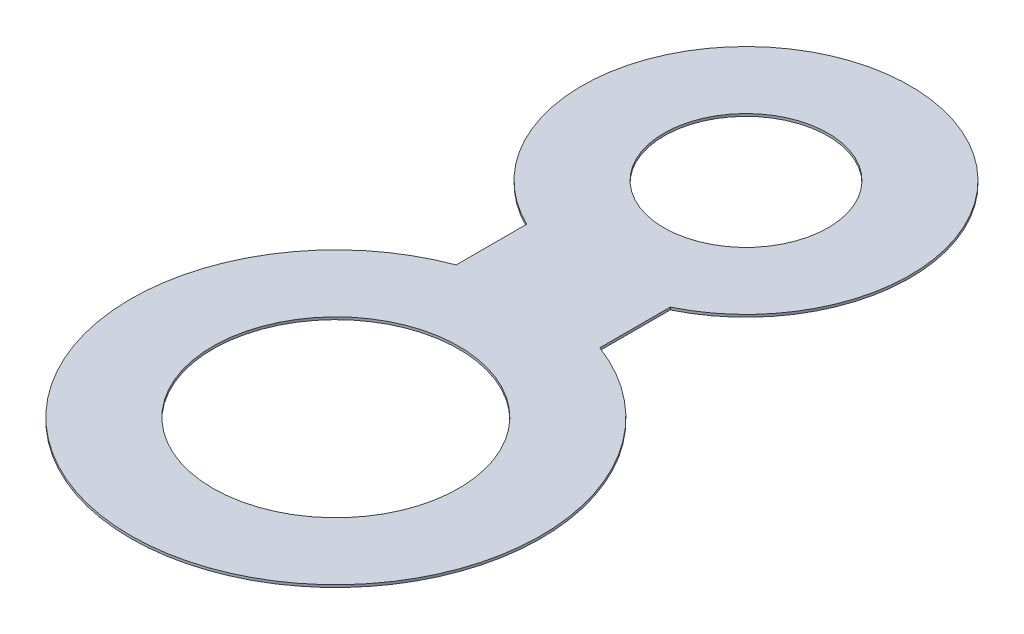
ISO-10303-21;
HEADER;
FILE_DESCRIPTION(('STEP AP214'),'2;1');
FILE_NAME('part.step','',(''),(''),'','','');
FILE_SCHEMA(('AUTOMOTIVE_DESIGN { 1 0 10303 214 1 1 1 1 }'));
ENDSEC;
DATA;
#1=APPLICATION_CONTEXT('core data for automotive mechanical design processes');
#2=APPLICATION_PROTOCOL_DEFINITION('international standard','automotive_design',2000,#1);
#3=PRODUCT_CONTEXT('',#1,'mechanical');
#4=PRODUCT('Part','Part','',(#3));
#5=PRODUCT_RELATED_PRODUCT_CATEGORY('part','',(#4));
#6=PRODUCT_DEFINITION_FORMATION('','',#4);
#7=PRODUCT_DEFINITION_CONTEXT('part definition',#1,'design');
#8=PRODUCT_DEFINITION('design','',#6,#7);
#9=PRODUCT_DEFINITION_SHAPE('','',#8);
#10=(LENGTH_UNIT() NAMED_UNIT(*) SI_UNIT(.MILLI.,.METRE.));
#11=(NAMED_UNIT(*) PLANE_ANGLE_UNIT() SI_UNIT($,.RADIAN.));
#12=(NAMED_UNIT(*) SI_UNIT($,.STERADIAN.) SOLID_ANGLE_UNIT());
#13=UNCERTAINTY_MEASURE_WITH_UNIT(LENGTH_MEASURE(1.E-05),#10,'distance_accuracy_value','');
#14=(GEOMETRIC_REPRESENTATION_CONTEXT(3) GLOBAL_UNCERTAINTY_ASSIGNED_CONTEXT((#13)) GLOBAL_UNIT_ASSIGNED_CONTEXT((#10,
#11,#12)) REPRESENTATION_CONTEXT('',''));
#15=CARTESIAN_POINT('',(0.,0.,0.));
#16=DIRECTION('',(0.,0.,1.));
#17=DIRECTION('',(1.,0.,0.));
#18=AXIS2_PLACEMENT_3D('',#15,#16,#17);
#19=CARTESIAN_POINT('',(0.,0.3,-50.));
#20=DIRECTION('',(0.,-1.,0.));
#21=DIRECTION('',(0.,0.,-1.));
#22=AXIS2_PLACEMENT_3D('',#19,#20,#21);
#23=CYLINDRICAL_SURFACE('',#22,20.);
#24=CARTESIAN_POINT('',(0.,0.,-50.));
#25=DIRECTION('',(0.,1.,0.));
#26=DIRECTION('',(0.,0.,1.));
#27=AXIS2_PLACEMENT_3D('',#24,#25,#26);
#28=CIRCLE('',#27,20.);
#29=CARTESIAN_POINT('',(8.75,0.,-32.0156317875773));
#30=VERTEX_POINT('',#29);
#31=CARTESIAN_POINT('',(-8.75,0.,-32.0156317875773));
#32=VERTEX_POINT('',#31);
#33=EDGE_CURVE('E118',#30,#32,#28,.T.);
#34=ORIENTED_EDGE('',*,*,#33,.T.);
#35=DIRECTION('',(0.,-1.,0.));
#36=VECTOR('',#35,1.);
#37=CARTESIAN_POINT('',(-8.75,0.3,-32.0156317875773));
#38=LINE('',#37,#36);
#39=CARTESIAN_POINT('',(-8.75,0.3,-32.0156317875773));
#40=VERTEX_POINT('',#39);
#41=EDGE_CURVE('E11',#40,#32,#38,.T.);
#42=ORIENTED_EDGE('',*,*,#41,.F.);
#43=CARTESIAN_POINT('',(0.,0.3,-50.));
#44=DIRECTION('',(0.,1.,0.));
#45=DIRECTION('',(0.,0.,1.));
#46=AXIS2_PLACEMENT_3D('',#43,#44,#45);
#47=CIRCLE('',#46,20.);
#48=CARTESIAN_POINT('',(8.75,0.3,-32.0156317875773));
#49=VERTEX_POINT('',#48);
#50=EDGE_CURVE('E92',#49,#40,#47,.T.);
#51=ORIENTED_EDGE('',*,*,#50,.F.);
#52=DIRECTION('',(0.,-1.,0.));
#53=VECTOR('',#52,1.);
#54=CARTESIAN_POINT('',(8.75,0.3,-32.0156317875773));
#55=LINE('',#54,#53);
#56=EDGE_CURVE('E58',#49,#30,#55,.T.);
#57=ORIENTED_EDGE('',*,*,#56,.T.);
#58=EDGE_LOOP('',(#34,#42,#51,#57));
#59=FACE_BOUND('',#58,.T.);
#60=ADVANCED_FACE('F41',(#59),#23,.T.);
#61=CARTESIAN_POINT('',(-8.74999999999999,0.3,0.));
#62=DIRECTION('',(1.,0.,0.));
#63=DIRECTION('',(0.,0.,-1.));
#64=AXIS2_PLACEMENT_3D('',#61,#62,#63);
#65=PLANE('',#64);
#66=DIRECTION('',(0.,0.,1.));
#67=VECTOR('',#66,1.);
#68=CARTESIAN_POINT('',(-8.74999999999999,0.,0.));
#69=LINE('',#68,#67);
#70=CARTESIAN_POINT('',(-8.75,0.,-23.418742493994));
#71=VERTEX_POINT('',#70);
#72=EDGE_CURVE('E98',#32,#71,#69,.T.);
#73=ORIENTED_EDGE('',*,*,#72,.T.);
#74=DIRECTION('',(0.,-1.,0.));
#75=VECTOR('',#74,1.);
#76=CARTESIAN_POINT('',(-8.75,0.3,-23.418742493994));
#77=LINE('',#76,#75);
#78=CARTESIAN_POINT('',(-8.75,0.3,-23.418742493994));
#79=VERTEX_POINT('',#78);
#80=EDGE_CURVE('E50',#79,#71,#77,.T.);
#81=ORIENTED_EDGE('',*,*,#80,.F.);
#82=DIRECTION('',(0.,0.,1.));
#83=VECTOR('',#82,1.);
#84=CARTESIAN_POINT('',(-8.74999999999999,0.3,0.));
#85=LINE('',#84,#83);
#86=EDGE_CURVE('E84',#40,#79,#85,.T.);
#87=ORIENTED_EDGE('',*,*,#86,.F.);
#88=ORIENTED_EDGE('',*,*,#41,.T.);
#89=EDGE_LOOP('',(#73,#81,#87,#88));
#90=FACE_BOUND('',#89,.T.);
#91=ADVANCED_FACE('F97',(#90),#65,.F.);
#92=CARTESIAN_POINT('',(0.,0.3,0.));
#93=DIRECTION('',(0.,-1.,0.));
#94=DIRECTION('',(0.,0.,-1.));
#95=AXIS2_PLACEMENT_3D('',#92,#93,#94);
#96=CYLINDRICAL_SURFACE('',#95,25.);
#97=CARTESIAN_POINT('',(0.,0.,0.));
#98=DIRECTION('',(0.,1.,0.));
#99=DIRECTION('',(0.,0.,1.));
#100=AXIS2_PLACEMENT_3D('',#97,#98,#99);
#101=CIRCLE('',#100,25.);
#102=CARTESIAN_POINT('',(8.75,0.,-23.418742493994));
#103=VERTEX_POINT('',#102);
#104=EDGE_CURVE('E123',#71,#103,#101,.T.);
#105=ORIENTED_EDGE('',*,*,#104,.T.);
#106=DIRECTION('',(0.,-1.,0.));
#107=VECTOR('',#106,1.);
#108=CARTESIAN_POINT('',(8.75,0.3,-23.418742493994));
#109=LINE('',#108,#107);
#110=CARTESIAN_POINT('',(8.75,0.3,-23.418742493994));
#111=VERTEX_POINT('',#110);
#112=EDGE_CURVE('E73',#111,#103,#109,.T.);
#113=ORIENTED_EDGE('',*,*,#112,.F.);
#114=CARTESIAN_POINT('',(0.,0.3,0.));
#115=DIRECTION('',(0.,1.,0.));
#116=DIRECTION('',(0.,0.,1.));
#117=AXIS2_PLACEMENT_3D('',#114,#115,#116);
#118=CIRCLE('',#117,25.);
#119=EDGE_CURVE('E91',#79,#111,#118,.T.);
#120=ORIENTED_EDGE('',*,*,#119,.F.);
#121=ORIENTED_EDGE('',*,*,#80,.T.);
#122=EDGE_LOOP('',(#105,#113,#120,#121));
#123=FACE_BOUND('',#122,.T.);
#124=ADVANCED_FACE('F102',(#123),#96,.T.);
#125=CARTESIAN_POINT('',(0.,0.3,-50.));
#126=DIRECTION('',(0.,-1.,0.));
#127=DIRECTION('',(0.,0.,-1.));
#128=AXIS2_PLACEMENT_3D('',#125,#126,#127);
#129=CYLINDRICAL_SURFACE('',#128,10.);
#130=CARTESIAN_POINT('',(0.,0.3,-50.));
#131=DIRECTION('',(0.,1.,0.));
#132=DIRECTION('',(0.,0.,1.));
#133=AXIS2_PLACEMENT_3D('',#130,#131,#132);
#134=CIRCLE('',#133,10.);
#135=CARTESIAN_POINT('',(0.,0.3,-40.));
#136=VERTEX_POINT('',#135);
#137=EDGE_CURVE('E107',#136,#136,#134,.T.);
#138=ORIENTED_EDGE('',*,*,#137,.T.);
#139=EDGE_LOOP('',(#138));
#140=FACE_BOUND('',#139,.T.);
#141=CARTESIAN_POINT('',(0.,0.,-50.));
#142=DIRECTION('',(0.,1.,0.));
#143=DIRECTION('',(0.,0.,1.));
#144=AXIS2_PLACEMENT_3D('',#141,#142,#143);
#145=CIRCLE('',#144,10.);
#146=CARTESIAN_POINT('',(0.,0.,-40.));
#147=VERTEX_POINT('',#146);
#148=EDGE_CURVE('E130',#147,#147,#145,.T.);
#149=ORIENTED_EDGE('',*,*,#148,.F.);
#150=EDGE_LOOP('',(#149));
#151=FACE_BOUND('',#150,.T.);
#152=ADVANCED_FACE('F156',(#140,#151),#129,.F.);
#153=CARTESIAN_POINT('',(8.75000000000001,0.3,0.));
#154=DIRECTION('',(1.,0.,0.));
#155=DIRECTION('',(0.,0.,-1.));
#156=AXIS2_PLACEMENT_3D('',#153,#154,#155);
#157=PLANE('',#156);
#158=DIRECTION('',(0.,0.,1.));
#159=VECTOR('',#158,1.);
#160=CARTESIAN_POINT('',(8.75000000000001,0.,0.));
#161=LINE('',#160,#159);
#162=EDGE_CURVE('E126',#30,#103,#161,.T.);
#163=ORIENTED_EDGE('',*,*,#162,.F.);
#164=ORIENTED_EDGE('',*,*,#56,.F.);
#165=DIRECTION('',(0.,0.,1.));
#166=VECTOR('',#165,1.);
#167=CARTESIAN_POINT('',(8.75000000000001,0.3,0.));
#168=LINE('',#167,#166);
#169=EDGE_CURVE('E104',#49,#111,#168,.T.);
#170=ORIENTED_EDGE('',*,*,#169,.T.);
#171=ORIENTED_EDGE('',*,*,#112,.T.);
#172=EDGE_LOOP('',(#163,#164,#170,#171));
#173=FACE_BOUND('',#172,.T.);
#174=ADVANCED_FACE('F148',(#173),#157,.T.);
#175=CARTESIAN_POINT('',(0.,0.3,0.));
#176=DIRECTION('',(0.,-1.,0.));
#177=DIRECTION('',(0.,0.,-1.));
#178=AXIS2_PLACEMENT_3D('',#175,#176,#177);
#179=CYLINDRICAL_SURFACE('',#178,15.);
#180=CARTESIAN_POINT('',(0.,0.3,0.));
#181=DIRECTION('',(0.,1.,0.));
#182=DIRECTION('',(0.,0.,1.));
#183=AXIS2_PLACEMENT_3D('',#180,#181,#182);
#184=CIRCLE('',#183,15.);
#185=CARTESIAN_POINT('',(0.,0.3,15.));
#186=VERTEX_POINT('',#185);
#187=EDGE_CURVE('E114',#186,#186,#184,.T.);
#188=ORIENTED_EDGE('',*,*,#187,.T.);
#189=EDGE_LOOP('',(#188));
#190=FACE_BOUND('',#189,.T.);
#191=CARTESIAN_POINT('',(0.,0.,0.));
#192=DIRECTION('',(0.,1.,0.));
#193=DIRECTION('',(0.,0.,1.));
#194=AXIS2_PLACEMENT_3D('',#191,#192,#193);
#195=CIRCLE('',#194,15.);
#196=CARTESIAN_POINT('',(0.,0.,15.));
#197=VERTEX_POINT('',#196);
#198=EDGE_CURVE('E134',#197,#197,#195,.T.);
#199=ORIENTED_EDGE('',*,*,#198,.F.);
#200=EDGE_LOOP('',(#199));
#201=FACE_BOUND('',#200,.T.);
#202=ADVANCED_FACE('F146',(#190,#201),#179,.F.);
#203=CARTESIAN_POINT('',(0.,0.3,0.));
#204=DIRECTION('',(0.,1.,0.));
#205=DIRECTION('',(0.,0.,1.));
#206=AXIS2_PLACEMENT_3D('',#203,#204,#205);
#207=PLANE('',#206);
#208=ORIENTED_EDGE('',*,*,#50,.T.);
#209=ORIENTED_EDGE('',*,*,#86,.T.);
#210=ORIENTED_EDGE('',*,*,#119,.T.);
#211=ORIENTED_EDGE('',*,*,#169,.F.);
#212=EDGE_LOOP('',(#208,#209,#210,#211));
#213=FACE_BOUND('',#212,.T.);
#214=ORIENTED_EDGE('',*,*,#137,.F.);
#215=EDGE_LOOP('',(#214));
#216=FACE_BOUND('',#215,.T.);
#217=ORIENTED_EDGE('',*,*,#187,.F.);
#218=EDGE_LOOP('',(#217));
#219=FACE_BOUND('',#218,.T.);
#220=ADVANCED_FACE('F87',(#213,#216,#219),#207,.T.);
#221=CARTESIAN_POINT('',(0.,0.,0.));
#222=DIRECTION('',(0.,1.,0.));
#223=DIRECTION('',(0.,0.,1.));
#224=AXIS2_PLACEMENT_3D('',#221,#222,#223);
#225=PLANE('',#224);
#226=ORIENTED_EDGE('',*,*,#33,.F.);
#227=ORIENTED_EDGE('',*,*,#162,.T.);
#228=ORIENTED_EDGE('',*,*,#104,.F.);
#229=ORIENTED_EDGE('',*,*,#72,.F.);
#230=EDGE_LOOP('',(#226,#227,#228,#229));
#231=FACE_BOUND('',#230,.T.);
#232=ORIENTED_EDGE('',*,*,#148,.T.);
#233=EDGE_LOOP('',(#232));
#234=FACE_BOUND('',#233,.T.);
#235=ORIENTED_EDGE('',*,*,#198,.T.);
#236=EDGE_LOOP('',(#235));
#237=FACE_BOUND('',#236,.T.);
#238=ADVANCED_FACE('F144',(#231,#234,#237),#225,.F.);
#239=CLOSED_SHELL('',(#60,#91,#124,#152,#174,#202,#220,#238));
#240=MANIFOLD_SOLID_BREP('B2',#239);
#241=ADVANCED_BREP_SHAPE_REPRESENTATION('',(#18,#240),#14);
#242=SHAPE_DEFINITION_REPRESENTATION(#9,#241);
ENDSEC;
END-ISO-10303-21;
